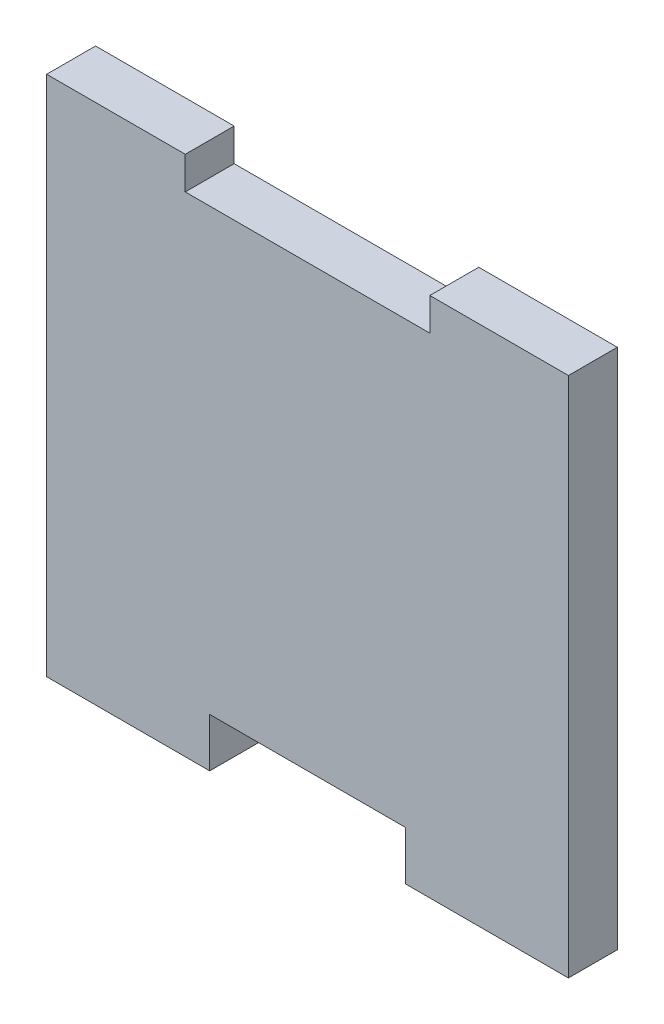
ISO-10303-21;
HEADER;
FILE_DESCRIPTION(('STEP AP214'),'2;1');
FILE_NAME('part.step','',(''),(''),'','','');
FILE_SCHEMA(('AUTOMOTIVE_DESIGN { 1 0 10303 214 1 1 1 1 }'));
ENDSEC;
DATA;
#1=APPLICATION_CONTEXT('core data for automotive mechanical design processes');
#2=APPLICATION_PROTOCOL_DEFINITION('international standard','automotive_design',2000,#1);
#3=PRODUCT_CONTEXT('',#1,'mechanical');
#4=PRODUCT('Part','Part','',(#3));
#5=PRODUCT_RELATED_PRODUCT_CATEGORY('part','',(#4));
#6=PRODUCT_DEFINITION_FORMATION('','',#4);
#7=PRODUCT_DEFINITION_CONTEXT('part definition',#1,'design');
#8=PRODUCT_DEFINITION('design','',#6,#7);
#9=PRODUCT_DEFINITION_SHAPE('','',#8);
#10=(LENGTH_UNIT() NAMED_UNIT(*) SI_UNIT(.MILLI.,.METRE.));
#11=(NAMED_UNIT(*) PLANE_ANGLE_UNIT() SI_UNIT($,.RADIAN.));
#12=(NAMED_UNIT(*) SI_UNIT($,.STERADIAN.) SOLID_ANGLE_UNIT());
#13=UNCERTAINTY_MEASURE_WITH_UNIT(LENGTH_MEASURE(1.E-05),#10,'distance_accuracy_value','');
#14=(GEOMETRIC_REPRESENTATION_CONTEXT(3) GLOBAL_UNCERTAINTY_ASSIGNED_CONTEXT((#13)) GLOBAL_UNIT_ASSIGNED_CONTEXT((#10,
#11,#12)) REPRESENTATION_CONTEXT('',''));
#15=CARTESIAN_POINT('',(0.,0.,0.));
#16=DIRECTION('',(0.,0.,1.));
#17=DIRECTION('',(1.,0.,0.));
#18=AXIS2_PLACEMENT_3D('',#15,#16,#17);
#19=CARTESIAN_POINT('',(31.8753328813559,32.2361572881356,3.));
#20=DIRECTION('',(-1.,0.,0.));
#21=DIRECTION('',(0.,-1.,0.));
#22=AXIS2_PLACEMENT_3D('',#19,#20,#21);
#23=PLANE('',#22);
#24=DIRECTION('',(0.,1.,0.));
#25=VECTOR('',#24,1.);
#26=CARTESIAN_POINT('',(31.8753328813559,32.2361572881356,0.));
#27=LINE('',#26,#25);
#28=CARTESIAN_POINT('',(31.8753328813559,30.2361572881356,0.));
#29=VERTEX_POINT('',#28);
#30=CARTESIAN_POINT('',(31.8753328813559,32.2361572881356,0.));
#31=VERTEX_POINT('',#30);
#32=EDGE_CURVE('E153',#29,#31,#27,.T.);
#33=ORIENTED_EDGE('',*,*,#32,.T.);
#34=DIRECTION('',(0.,0.,-1.));
#35=VECTOR('',#34,1.);
#36=CARTESIAN_POINT('',(31.8753328813559,32.2361572881356,3.));
#37=LINE('',#36,#35);
#38=CARTESIAN_POINT('',(31.8753328813559,32.2361572881356,3.));
#39=VERTEX_POINT('',#38);
#40=EDGE_CURVE('E11',#39,#31,#37,.T.);
#41=ORIENTED_EDGE('',*,*,#40,.F.);
#42=DIRECTION('',(0.,1.,0.));
#43=VECTOR('',#42,1.);
#44=CARTESIAN_POINT('',(31.8753328813559,32.2361572881356,3.));
#45=LINE('',#44,#43);
#46=CARTESIAN_POINT('',(31.8753328813559,30.2361572881356,3.));
#47=VERTEX_POINT('',#46);
#48=EDGE_CURVE('E175',#47,#39,#45,.T.);
#49=ORIENTED_EDGE('',*,*,#48,.F.);
#50=DIRECTION('',(0.,0.,-1.));
#51=VECTOR('',#50,1.);
#52=CARTESIAN_POINT('',(31.8753328813559,30.2361572881356,3.));
#53=LINE('',#52,#51);
#54=EDGE_CURVE('E149',#47,#29,#53,.T.);
#55=ORIENTED_EDGE('',*,*,#54,.T.);
#56=EDGE_LOOP('',(#33,#41,#49,#55));
#57=FACE_BOUND('',#56,.T.);
#58=ADVANCED_FACE('F33',(#57),#23,.F.);
#59=CARTESIAN_POINT('',(31.8753328813559,32.2361572881356,3.));
#60=DIRECTION('',(0.,-1.,0.));
#61=DIRECTION('',(0.,0.,-1.));
#62=AXIS2_PLACEMENT_3D('',#59,#60,#61);
#63=PLANE('',#62);
#64=DIRECTION('',(-1.,0.,0.));
#65=VECTOR('',#64,1.);
#66=CARTESIAN_POINT('',(31.8753328813559,32.2361572881356,0.));
#67=LINE('',#66,#65);
#68=CARTESIAN_POINT('',(23.3753328813559,32.2361572881356,0.));
#69=VERTEX_POINT('',#68);
#70=EDGE_CURVE('E156',#31,#69,#67,.T.);
#71=ORIENTED_EDGE('',*,*,#70,.T.);
#72=DIRECTION('',(0.,0.,-1.));
#73=VECTOR('',#72,1.);
#74=CARTESIAN_POINT('',(23.3753328813559,32.2361572881356,3.));
#75=LINE('',#74,#73);
#76=CARTESIAN_POINT('',(23.3753328813559,32.2361572881356,3.));
#77=VERTEX_POINT('',#76);
#78=EDGE_CURVE('E41',#77,#69,#75,.T.);
#79=ORIENTED_EDGE('',*,*,#78,.F.);
#80=DIRECTION('',(-1.,0.,0.));
#81=VECTOR('',#80,1.);
#82=CARTESIAN_POINT('',(31.8753328813559,32.2361572881356,3.));
#83=LINE('',#82,#81);
#84=EDGE_CURVE('E104',#39,#77,#83,.T.);
#85=ORIENTED_EDGE('',*,*,#84,.F.);
#86=ORIENTED_EDGE('',*,*,#40,.T.);
#87=EDGE_LOOP('',(#71,#79,#85,#86));
#88=FACE_BOUND('',#87,.T.);
#89=ADVANCED_FACE('F253',(#88),#63,.F.);
#90=CARTESIAN_POINT('',(23.3753328813559,32.2361572881356,3.));
#91=DIRECTION('',(1.,0.,0.));
#92=DIRECTION('',(0.,0.,-1.));
#93=AXIS2_PLACEMENT_3D('',#90,#91,#92);
#94=PLANE('',#93);
#95=DIRECTION('',(0.,-1.,0.));
#96=VECTOR('',#95,1.);
#97=CARTESIAN_POINT('',(23.3753328813559,32.2361572881356,0.));
#98=LINE('',#97,#96);
#99=CARTESIAN_POINT('',(23.3753328813559,0.236157288135577,0.));
#100=VERTEX_POINT('',#99);
#101=EDGE_CURVE('E158',#69,#100,#98,.T.);
#102=ORIENTED_EDGE('',*,*,#101,.T.);
#103=DIRECTION('',(0.,0.,-1.));
#104=VECTOR('',#103,1.);
#105=CARTESIAN_POINT('',(23.3753328813559,0.236157288135577,3.));
#106=LINE('',#105,#104);
#107=CARTESIAN_POINT('',(23.3753328813559,0.236157288135577,3.));
#108=VERTEX_POINT('',#107);
#109=EDGE_CURVE('E194',#108,#100,#106,.T.);
#110=ORIENTED_EDGE('',*,*,#109,.F.);
#111=DIRECTION('',(0.,-1.,0.));
#112=VECTOR('',#111,1.);
#113=CARTESIAN_POINT('',(23.3753328813559,32.2361572881356,3.));
#114=LINE('',#113,#112);
#115=EDGE_CURVE('E202',#77,#108,#114,.T.);
#116=ORIENTED_EDGE('',*,*,#115,.F.);
#117=ORIENTED_EDGE('',*,*,#78,.T.);
#118=EDGE_LOOP('',(#102,#110,#116,#117));
#119=FACE_BOUND('',#118,.T.);
#120=ADVANCED_FACE('F200',(#119),#94,.F.);
#121=CARTESIAN_POINT('',(33.3753328813559,0.236157288135577,3.));
#122=DIRECTION('',(0.,1.,0.));
#123=DIRECTION('',(0.,0.,1.));
#124=AXIS2_PLACEMENT_3D('',#121,#122,#123);
#125=PLANE('',#124);
#126=DIRECTION('',(1.,0.,0.));
#127=VECTOR('',#126,1.);
#128=CARTESIAN_POINT('',(33.3753328813559,0.236157288135577,0.));
#129=LINE('',#128,#127);
#130=CARTESIAN_POINT('',(33.3753328813559,0.236157288135577,0.));
#131=VERTEX_POINT('',#130);
#132=EDGE_CURVE('E160',#100,#131,#129,.T.);
#133=ORIENTED_EDGE('',*,*,#132,.T.);
#134=DIRECTION('',(0.,0.,-1.));
#135=VECTOR('',#134,1.);
#136=CARTESIAN_POINT('',(33.3753328813559,0.236157288135577,3.));
#137=LINE('',#136,#135);
#138=CARTESIAN_POINT('',(33.3753328813559,0.236157288135577,3.));
#139=VERTEX_POINT('',#138);
#140=EDGE_CURVE('E191',#139,#131,#137,.T.);
#141=ORIENTED_EDGE('',*,*,#140,.F.);
#142=DIRECTION('',(1.,0.,0.));
#143=VECTOR('',#142,1.);
#144=CARTESIAN_POINT('',(33.3753328813559,0.236157288135577,3.));
#145=LINE('',#144,#143);
#146=EDGE_CURVE('E220',#108,#139,#145,.T.);
#147=ORIENTED_EDGE('',*,*,#146,.F.);
#148=ORIENTED_EDGE('',*,*,#109,.T.);
#149=EDGE_LOOP('',(#133,#141,#147,#148));
#150=FACE_BOUND('',#149,.T.);
#151=ADVANCED_FACE('F211',(#150),#125,.F.);
#152=CARTESIAN_POINT('',(33.3753328813559,3.23615728813558,3.));
#153=DIRECTION('',(-1.,0.,0.));
#154=DIRECTION('',(0.,0.,1.));
#155=AXIS2_PLACEMENT_3D('',#152,#153,#154);
#156=PLANE('',#155);
#157=DIRECTION('',(0.,1.,0.));
#158=VECTOR('',#157,1.);
#159=CARTESIAN_POINT('',(33.3753328813559,3.23615728813558,0.));
#160=LINE('',#159,#158);
#161=CARTESIAN_POINT('',(33.3753328813559,3.23615728813558,0.));
#162=VERTEX_POINT('',#161);
#163=EDGE_CURVE('E162',#131,#162,#160,.T.);
#164=ORIENTED_EDGE('',*,*,#163,.T.);
#165=DIRECTION('',(0.,0.,-1.));
#166=VECTOR('',#165,1.);
#167=CARTESIAN_POINT('',(33.3753328813559,3.23615728813558,3.));
#168=LINE('',#167,#166);
#169=CARTESIAN_POINT('',(33.3753328813559,3.23615728813558,3.));
#170=VERTEX_POINT('',#169);
#171=EDGE_CURVE('E188',#170,#162,#168,.T.);
#172=ORIENTED_EDGE('',*,*,#171,.F.);
#173=DIRECTION('',(0.,1.,0.));
#174=VECTOR('',#173,1.);
#175=CARTESIAN_POINT('',(33.3753328813559,3.23615728813558,3.));
#176=LINE('',#175,#174);
#177=EDGE_CURVE('E217',#139,#170,#176,.T.);
#178=ORIENTED_EDGE('',*,*,#177,.F.);
#179=ORIENTED_EDGE('',*,*,#140,.T.);
#180=EDGE_LOOP('',(#164,#172,#178,#179));
#181=FACE_BOUND('',#180,.T.);
#182=ADVANCED_FACE('F215',(#181),#156,.F.);
#183=CARTESIAN_POINT('',(33.3753328813559,3.23615728813558,3.));
#184=DIRECTION('',(0.,1.,0.));
#185=DIRECTION('',(-1.,0.,0.));
#186=AXIS2_PLACEMENT_3D('',#183,#184,#185);
#187=PLANE('',#186);
#188=DIRECTION('',(1.,0.,0.));
#189=VECTOR('',#188,1.);
#190=CARTESIAN_POINT('',(33.3753328813559,3.23615728813558,0.));
#191=LINE('',#190,#189);
#192=CARTESIAN_POINT('',(45.3753328813559,3.23615728813558,0.));
#193=VERTEX_POINT('',#192);
#194=EDGE_CURVE('E164',#162,#193,#191,.T.);
#195=ORIENTED_EDGE('',*,*,#194,.T.);
#196=DIRECTION('',(0.,0.,-1.));
#197=VECTOR('',#196,1.);
#198=CARTESIAN_POINT('',(45.3753328813559,3.23615728813558,3.));
#199=LINE('',#198,#197);
#200=CARTESIAN_POINT('',(45.3753328813559,3.23615728813558,3.));
#201=VERTEX_POINT('',#200);
#202=EDGE_CURVE('E185',#201,#193,#199,.T.);
#203=ORIENTED_EDGE('',*,*,#202,.F.);
#204=DIRECTION('',(1.,0.,0.));
#205=VECTOR('',#204,1.);
#206=CARTESIAN_POINT('',(33.3753328813559,3.23615728813558,3.));
#207=LINE('',#206,#205);
#208=EDGE_CURVE('E219',#170,#201,#207,.T.);
#209=ORIENTED_EDGE('',*,*,#208,.F.);
#210=ORIENTED_EDGE('',*,*,#171,.T.);
#211=EDGE_LOOP('',(#195,#203,#209,#210));
#212=FACE_BOUND('',#211,.T.);
#213=ADVANCED_FACE('F266',(#212),#187,.F.);
#214=CARTESIAN_POINT('',(45.3753328813559,3.23615728813558,3.));
#215=DIRECTION('',(1.,0.,0.));
#216=DIRECTION('',(0.,0.,-1.));
#217=AXIS2_PLACEMENT_3D('',#214,#215,#216);
#218=PLANE('',#217);
#219=DIRECTION('',(0.,-1.,0.));
#220=VECTOR('',#219,1.);
#221=CARTESIAN_POINT('',(45.3753328813559,3.23615728813558,0.));
#222=LINE('',#221,#220);
#223=CARTESIAN_POINT('',(45.3753328813559,0.236157288135562,0.));
#224=VERTEX_POINT('',#223);
#225=EDGE_CURVE('E166',#193,#224,#222,.T.);
#226=ORIENTED_EDGE('',*,*,#225,.T.);
#227=DIRECTION('',(0.,0.,-1.));
#228=VECTOR('',#227,1.);
#229=CARTESIAN_POINT('',(45.3753328813559,0.236157288135562,3.));
#230=LINE('',#229,#228);
#231=CARTESIAN_POINT('',(45.3753328813559,0.236157288135562,3.));
#232=VERTEX_POINT('',#231);
#233=EDGE_CURVE('E182',#232,#224,#230,.T.);
#234=ORIENTED_EDGE('',*,*,#233,.F.);
#235=DIRECTION('',(0.,-1.,0.));
#236=VECTOR('',#235,1.);
#237=CARTESIAN_POINT('',(45.3753328813559,3.23615728813558,3.));
#238=LINE('',#237,#236);
#239=EDGE_CURVE('E222',#201,#232,#238,.T.);
#240=ORIENTED_EDGE('',*,*,#239,.F.);
#241=ORIENTED_EDGE('',*,*,#202,.T.);
#242=EDGE_LOOP('',(#226,#234,#240,#241));
#243=FACE_BOUND('',#242,.T.);
#244=ADVANCED_FACE('F269',(#243),#218,.F.);
#245=CARTESIAN_POINT('',(45.3753328813559,0.236157288135562,3.));
#246=DIRECTION('',(0.,1.,0.));
#247=DIRECTION('',(0.,0.,1.));
#248=AXIS2_PLACEMENT_3D('',#245,#246,#247);
#249=PLANE('',#248);
#250=DIRECTION('',(1.,0.,0.));
#251=VECTOR('',#250,1.);
#252=CARTESIAN_POINT('',(45.3753328813559,0.236157288135562,0.));
#253=LINE('',#252,#251);
#254=CARTESIAN_POINT('',(55.3753328813559,0.236157288135562,0.));
#255=VERTEX_POINT('',#254);
#256=EDGE_CURVE('E168',#224,#255,#253,.T.);
#257=ORIENTED_EDGE('',*,*,#256,.T.);
#258=DIRECTION('',(0.,0.,-1.));
#259=VECTOR('',#258,1.);
#260=CARTESIAN_POINT('',(55.3753328813559,0.236157288135562,3.));
#261=LINE('',#260,#259);
#262=CARTESIAN_POINT('',(55.3753328813559,0.236157288135562,3.));
#263=VERTEX_POINT('',#262);
#264=EDGE_CURVE('E179',#263,#255,#261,.T.);
#265=ORIENTED_EDGE('',*,*,#264,.F.);
#266=DIRECTION('',(1.,0.,0.));
#267=VECTOR('',#266,1.);
#268=CARTESIAN_POINT('',(45.3753328813559,0.236157288135562,3.));
#269=LINE('',#268,#267);
#270=EDGE_CURVE('E228',#232,#263,#269,.T.);
#271=ORIENTED_EDGE('',*,*,#270,.F.);
#272=ORIENTED_EDGE('',*,*,#233,.T.);
#273=EDGE_LOOP('',(#257,#265,#271,#272));
#274=FACE_BOUND('',#273,.T.);
#275=ADVANCED_FACE('F234',(#274),#249,.F.);
#276=CARTESIAN_POINT('',(55.3753328813559,0.236157288135562,3.));
#277=DIRECTION('',(-1.,0.,0.));
#278=DIRECTION('',(0.,0.,1.));
#279=AXIS2_PLACEMENT_3D('',#276,#277,#278);
#280=PLANE('',#279);
#281=DIRECTION('',(0.,1.,0.));
#282=VECTOR('',#281,1.);
#283=CARTESIAN_POINT('',(55.3753328813559,0.236157288135562,0.));
#284=LINE('',#283,#282);
#285=CARTESIAN_POINT('',(55.3753328813559,32.2361572881356,0.));
#286=VERTEX_POINT('',#285);
#287=EDGE_CURVE('E170',#255,#286,#284,.T.);
#288=ORIENTED_EDGE('',*,*,#287,.T.);
#289=DIRECTION('',(0.,0.,-1.));
#290=VECTOR('',#289,1.);
#291=CARTESIAN_POINT('',(55.3753328813559,32.2361572881356,3.));
#292=LINE('',#291,#290);
#293=CARTESIAN_POINT('',(55.3753328813559,32.2361572881356,3.));
#294=VERTEX_POINT('',#293);
#295=EDGE_CURVE('E144',#294,#286,#292,.T.);
#296=ORIENTED_EDGE('',*,*,#295,.F.);
#297=DIRECTION('',(0.,1.,0.));
#298=VECTOR('',#297,1.);
#299=CARTESIAN_POINT('',(55.3753328813559,0.236157288135562,3.));
#300=LINE('',#299,#298);
#301=EDGE_CURVE('E135',#263,#294,#300,.T.);
#302=ORIENTED_EDGE('',*,*,#301,.F.);
#303=ORIENTED_EDGE('',*,*,#264,.T.);
#304=EDGE_LOOP('',(#288,#296,#302,#303));
#305=FACE_BOUND('',#304,.T.);
#306=ADVANCED_FACE('F238',(#305),#280,.F.);
#307=CARTESIAN_POINT('',(46.8753328813559,32.2361572881356,3.));
#308=DIRECTION('',(0.,-1.,0.));
#309=DIRECTION('',(0.,0.,-1.));
#310=AXIS2_PLACEMENT_3D('',#307,#308,#309);
#311=PLANE('',#310);
#312=DIRECTION('',(-1.,0.,0.));
#313=VECTOR('',#312,1.);
#314=CARTESIAN_POINT('',(46.8753328813559,32.2361572881356,0.));
#315=LINE('',#314,#313);
#316=CARTESIAN_POINT('',(46.8753328813559,32.2361572881356,0.));
#317=VERTEX_POINT('',#316);
#318=EDGE_CURVE('E143',#286,#317,#315,.T.);
#319=ORIENTED_EDGE('',*,*,#318,.T.);
#320=DIRECTION('',(0.,0.,-1.));
#321=VECTOR('',#320,1.);
#322=CARTESIAN_POINT('',(46.8753328813559,32.2361572881356,3.));
#323=LINE('',#322,#321);
#324=CARTESIAN_POINT('',(46.8753328813559,32.2361572881356,3.));
#325=VERTEX_POINT('',#324);
#326=EDGE_CURVE('E140',#325,#317,#323,.T.);
#327=ORIENTED_EDGE('',*,*,#326,.F.);
#328=DIRECTION('',(-1.,0.,0.));
#329=VECTOR('',#328,1.);
#330=CARTESIAN_POINT('',(46.8753328813559,32.2361572881356,3.));
#331=LINE('',#330,#329);
#332=EDGE_CURVE('E129',#294,#325,#331,.T.);
#333=ORIENTED_EDGE('',*,*,#332,.F.);
#334=ORIENTED_EDGE('',*,*,#295,.T.);
#335=EDGE_LOOP('',(#319,#327,#333,#334));
#336=FACE_BOUND('',#335,.T.);
#337=ADVANCED_FACE('F141',(#336),#311,.F.);
#338=CARTESIAN_POINT('',(46.8753328813559,30.2361572881356,3.));
#339=DIRECTION('',(1.,0.,0.));
#340=DIRECTION('',(0.,0.,-1.));
#341=AXIS2_PLACEMENT_3D('',#338,#339,#340);
#342=PLANE('',#341);
#343=DIRECTION('',(0.,-1.,0.));
#344=VECTOR('',#343,1.);
#345=CARTESIAN_POINT('',(46.8753328813559,30.2361572881356,0.));
#346=LINE('',#345,#344);
#347=CARTESIAN_POINT('',(46.8753328813559,30.2361572881356,0.));
#348=VERTEX_POINT('',#347);
#349=EDGE_CURVE('E90',#317,#348,#346,.T.);
#350=ORIENTED_EDGE('',*,*,#349,.T.);
#351=DIRECTION('',(0.,0.,-1.));
#352=VECTOR('',#351,1.);
#353=CARTESIAN_POINT('',(46.8753328813559,30.2361572881356,3.));
#354=LINE('',#353,#352);
#355=CARTESIAN_POINT('',(46.8753328813559,30.2361572881356,3.));
#356=VERTEX_POINT('',#355);
#357=EDGE_CURVE('E145',#356,#348,#354,.T.);
#358=ORIENTED_EDGE('',*,*,#357,.F.);
#359=DIRECTION('',(0.,-1.,0.));
#360=VECTOR('',#359,1.);
#361=CARTESIAN_POINT('',(46.8753328813559,30.2361572881356,3.));
#362=LINE('',#361,#360);
#363=EDGE_CURVE('E133',#325,#356,#362,.T.);
#364=ORIENTED_EDGE('',*,*,#363,.F.);
#365=ORIENTED_EDGE('',*,*,#326,.T.);
#366=EDGE_LOOP('',(#350,#358,#364,#365));
#367=FACE_BOUND('',#366,.T.);
#368=ADVANCED_FACE('F147',(#367),#342,.F.);
#369=CARTESIAN_POINT('',(46.8753328813559,30.2361572881356,3.));
#370=DIRECTION('',(0.,-1.,0.));
#371=DIRECTION('',(0.,0.,-1.));
#372=AXIS2_PLACEMENT_3D('',#369,#370,#371);
#373=PLANE('',#372);
#374=DIRECTION('',(-1.,0.,0.));
#375=VECTOR('',#374,1.);
#376=CARTESIAN_POINT('',(46.8753328813559,30.2361572881356,0.));
#377=LINE('',#376,#375);
#378=EDGE_CURVE('E96',#348,#29,#377,.T.);
#379=ORIENTED_EDGE('',*,*,#378,.T.);
#380=ORIENTED_EDGE('',*,*,#54,.F.);
#381=DIRECTION('',(-1.,0.,0.));
#382=VECTOR('',#381,1.);
#383=CARTESIAN_POINT('',(46.8753328813559,30.2361572881356,3.));
#384=LINE('',#383,#382);
#385=EDGE_CURVE('E49',#356,#47,#384,.T.);
#386=ORIENTED_EDGE('',*,*,#385,.F.);
#387=ORIENTED_EDGE('',*,*,#357,.T.);
#388=EDGE_LOOP('',(#379,#380,#386,#387));
#389=FACE_BOUND('',#388,.T.);
#390=ADVANCED_FACE('F242',(#389),#373,.F.);
#391=CARTESIAN_POINT('',(0.,0.,3.));
#392=DIRECTION('',(0.,0.,-1.));
#393=DIRECTION('',(-1.,0.,0.));
#394=AXIS2_PLACEMENT_3D('',#391,#392,#393);
#395=PLANE('',#394);
#396=ORIENTED_EDGE('',*,*,#48,.T.);
#397=ORIENTED_EDGE('',*,*,#84,.T.);
#398=ORIENTED_EDGE('',*,*,#115,.T.);
#399=ORIENTED_EDGE('',*,*,#146,.T.);
#400=ORIENTED_EDGE('',*,*,#177,.T.);
#401=ORIENTED_EDGE('',*,*,#208,.T.);
#402=ORIENTED_EDGE('',*,*,#239,.T.);
#403=ORIENTED_EDGE('',*,*,#270,.T.);
#404=ORIENTED_EDGE('',*,*,#301,.T.);
#405=ORIENTED_EDGE('',*,*,#332,.T.);
#406=ORIENTED_EDGE('',*,*,#363,.T.);
#407=ORIENTED_EDGE('',*,*,#385,.T.);
#408=EDGE_LOOP('',(#396,#397,#398,#399,#400,#401,#402,#403,#404,#405,#406,#407));
#409=FACE_BOUND('',#408,.T.);
#410=ADVANCED_FACE('F131',(#409),#395,.F.);
#411=CARTESIAN_POINT('',(0.,0.,0.));
#412=DIRECTION('',(0.,0.,-1.));
#413=DIRECTION('',(-1.,0.,0.));
#414=AXIS2_PLACEMENT_3D('',#411,#412,#413);
#415=PLANE('',#414);
#416=ORIENTED_EDGE('',*,*,#32,.F.);
#417=ORIENTED_EDGE('',*,*,#378,.F.);
#418=ORIENTED_EDGE('',*,*,#349,.F.);
#419=ORIENTED_EDGE('',*,*,#318,.F.);
#420=ORIENTED_EDGE('',*,*,#287,.F.);
#421=ORIENTED_EDGE('',*,*,#256,.F.);
#422=ORIENTED_EDGE('',*,*,#225,.F.);
#423=ORIENTED_EDGE('',*,*,#194,.F.);
#424=ORIENTED_EDGE('',*,*,#163,.F.);
#425=ORIENTED_EDGE('',*,*,#132,.F.);
#426=ORIENTED_EDGE('',*,*,#101,.F.);
#427=ORIENTED_EDGE('',*,*,#70,.F.);
#428=EDGE_LOOP('',(#416,#417,#418,#419,#420,#421,#422,#423,#424,#425,#426,#427));
#429=FACE_BOUND('',#428,.T.);
#430=ADVANCED_FACE('F206',(#429),#415,.T.);
#431=CLOSED_SHELL('',(#58,#89,#120,#151,#182,#213,#244,#275,#306,#337,#368,#390,#410,#430));
#432=MANIFOLD_SOLID_BREP('B2',#431);
#433=ADVANCED_BREP_SHAPE_REPRESENTATION('',(#18,#432),#14);
#434=SHAPE_DEFINITION_REPRESENTATION(#9,#433);
ENDSEC;
END-ISO-10303-21;
